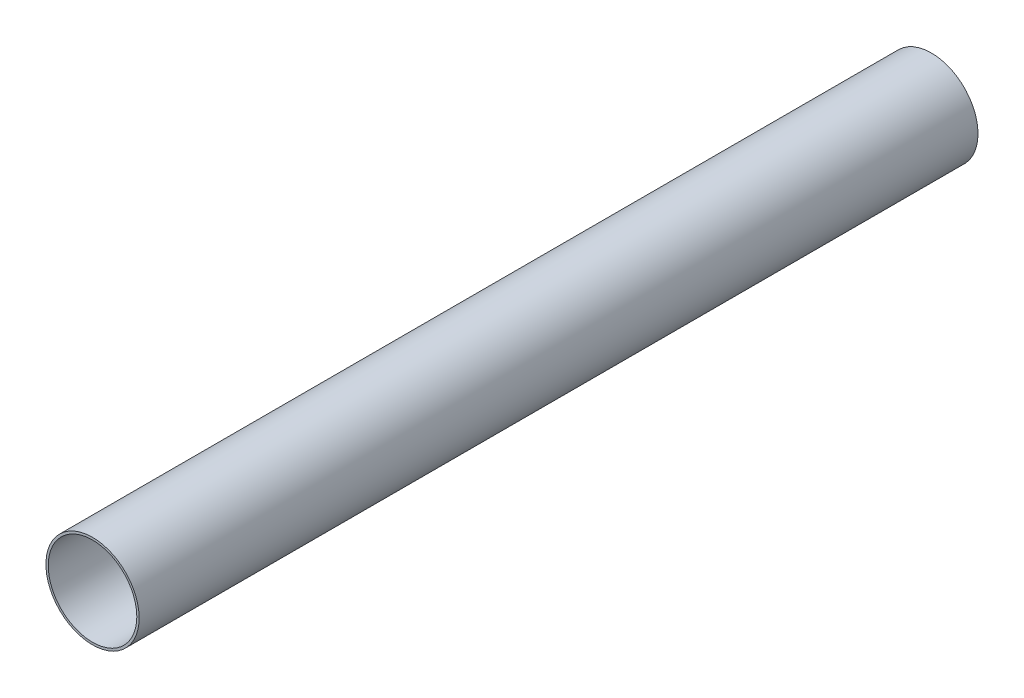
ISO-10303-21;
HEADER;
FILE_DESCRIPTION(('STEP AP214'),'2;1');
FILE_NAME('part.step','',(''),(''),'','','');
FILE_SCHEMA(('AUTOMOTIVE_DESIGN { 1 0 10303 214 1 1 1 1 }'));
ENDSEC;
DATA;
#1=APPLICATION_CONTEXT('core data for automotive mechanical design processes');
#2=APPLICATION_PROTOCOL_DEFINITION('international standard','automotive_design',2000,#1);
#3=PRODUCT_CONTEXT('',#1,'mechanical');
#4=PRODUCT('Part','Part','',(#3));
#5=PRODUCT_RELATED_PRODUCT_CATEGORY('part','',(#4));
#6=PRODUCT_DEFINITION_FORMATION('','',#4);
#7=PRODUCT_DEFINITION_CONTEXT('part definition',#1,'design');
#8=PRODUCT_DEFINITION('design','',#6,#7);
#9=PRODUCT_DEFINITION_SHAPE('','',#8);
#10=(LENGTH_UNIT() NAMED_UNIT(*) SI_UNIT(.MILLI.,.METRE.));
#11=(NAMED_UNIT(*) PLANE_ANGLE_UNIT() SI_UNIT($,.RADIAN.));
#12=(NAMED_UNIT(*) SI_UNIT($,.STERADIAN.) SOLID_ANGLE_UNIT());
#13=UNCERTAINTY_MEASURE_WITH_UNIT(LENGTH_MEASURE(1.E-05),#10,'distance_accuracy_value','');
#14=(GEOMETRIC_REPRESENTATION_CONTEXT(3) GLOBAL_UNCERTAINTY_ASSIGNED_CONTEXT((#13)) GLOBAL_UNIT_ASSIGNED_CONTEXT((#10,
#11,#12)) REPRESENTATION_CONTEXT('',''));
#15=CARTESIAN_POINT('',(0.,0.,0.));
#16=DIRECTION('',(0.,0.,1.));
#17=DIRECTION('',(1.,0.,0.));
#18=AXIS2_PLACEMENT_3D('',#15,#16,#17);
#19=CARTESIAN_POINT('',(0.,0.,5486.4));
#20=DIRECTION('',(0.,0.,1.));
#21=DIRECTION('',(1.,0.,0.));
#22=AXIS2_PLACEMENT_3D('',#19,#20,#21);
#23=PLANE('',#22);
#24=CARTESIAN_POINT('',(0.,0.,5486.4));
#25=DIRECTION('',(0.,0.,1.));
#26=DIRECTION('',(1.,0.,0.));
#27=AXIS2_PLACEMENT_3D('',#24,#25,#26);
#28=CIRCLE('',#27,304.8);
#29=CARTESIAN_POINT('',(304.8,0.,5486.4));
#30=VERTEX_POINT('',#29);
#31=EDGE_CURVE('E10',#30,#30,#28,.T.);
#32=ORIENTED_EDGE('',*,*,#31,.T.);
#33=EDGE_LOOP('',(#32));
#34=FACE_BOUND('',#33,.T.);
#35=CARTESIAN_POINT('',(0.,0.,5486.4));
#36=DIRECTION('',(0.,0.,1.));
#37=DIRECTION('',(1.,0.,0.));
#38=AXIS2_PLACEMENT_3D('',#35,#36,#37);
#39=CIRCLE('',#38,289.7124);
#40=CARTESIAN_POINT('',(289.7124,0.,5486.4));
#41=VERTEX_POINT('',#40);
#42=EDGE_CURVE('E39',#41,#41,#39,.T.);
#43=ORIENTED_EDGE('',*,*,#42,.F.);
#44=EDGE_LOOP('',(#43));
#45=FACE_BOUND('',#44,.T.);
#46=ADVANCED_FACE('F28',(#34,#45),#23,.T.);
#47=CARTESIAN_POINT('',(0.,0.,0.));
#48=DIRECTION('',(0.,0.,1.));
#49=DIRECTION('',(1.,0.,0.));
#50=AXIS2_PLACEMENT_3D('',#47,#48,#49);
#51=PLANE('',#50);
#52=CARTESIAN_POINT('',(0.,0.,0.));
#53=DIRECTION('',(0.,0.,1.));
#54=DIRECTION('',(1.,0.,0.));
#55=AXIS2_PLACEMENT_3D('',#52,#53,#54);
#56=CIRCLE('',#55,304.8);
#57=CARTESIAN_POINT('',(304.8,0.,0.));
#58=VERTEX_POINT('',#57);
#59=EDGE_CURVE('E32',#58,#58,#56,.T.);
#60=ORIENTED_EDGE('',*,*,#59,.F.);
#61=EDGE_LOOP('',(#60));
#62=FACE_BOUND('',#61,.T.);
#63=CARTESIAN_POINT('',(0.,0.,0.));
#64=DIRECTION('',(0.,0.,1.));
#65=DIRECTION('',(1.,0.,0.));
#66=AXIS2_PLACEMENT_3D('',#63,#64,#65);
#67=CIRCLE('',#66,289.7124);
#68=CARTESIAN_POINT('',(289.7124,0.,0.));
#69=VERTEX_POINT('',#68);
#70=EDGE_CURVE('E41',#69,#69,#67,.T.);
#71=ORIENTED_EDGE('',*,*,#70,.T.);
#72=EDGE_LOOP('',(#71));
#73=FACE_BOUND('',#72,.T.);
#74=ADVANCED_FACE('F51',(#62,#73),#51,.F.);
#75=CARTESIAN_POINT('',(0.,0.,5486.4));
#76=DIRECTION('',(0.,0.,-1.));
#77=DIRECTION('',(-1.,0.,0.));
#78=AXIS2_PLACEMENT_3D('',#75,#76,#77);
#79=CYLINDRICAL_SURFACE('',#78,304.8);
#80=ORIENTED_EDGE('',*,*,#31,.F.);
#81=EDGE_LOOP('',(#80));
#82=FACE_BOUND('',#81,.T.);
#83=ORIENTED_EDGE('',*,*,#59,.T.);
#84=EDGE_LOOP('',(#83));
#85=FACE_BOUND('',#84,.T.);
#86=ADVANCED_FACE('F30',(#82,#85),#79,.T.);
#87=CARTESIAN_POINT('',(0.,0.,5486.4));
#88=DIRECTION('',(0.,0.,-1.));
#89=DIRECTION('',(-1.,0.,0.));
#90=AXIS2_PLACEMENT_3D('',#87,#88,#89);
#91=CYLINDRICAL_SURFACE('',#90,289.7124);
#92=ORIENTED_EDGE('',*,*,#42,.T.);
#93=EDGE_LOOP('',(#92));
#94=FACE_BOUND('',#93,.T.);
#95=ORIENTED_EDGE('',*,*,#70,.F.);
#96=EDGE_LOOP('',(#95));
#97=FACE_BOUND('',#96,.T.);
#98=ADVANCED_FACE('F47',(#94,#97),#91,.F.);
#99=CLOSED_SHELL('',(#46,#74,#86,#98));
#100=MANIFOLD_SOLID_BREP('B2',#99);
#101=ADVANCED_BREP_SHAPE_REPRESENTATION('',(#18,#100),#14);
#102=SHAPE_DEFINITION_REPRESENTATION(#9,#101);
ENDSEC;
END-ISO-10303-21;
